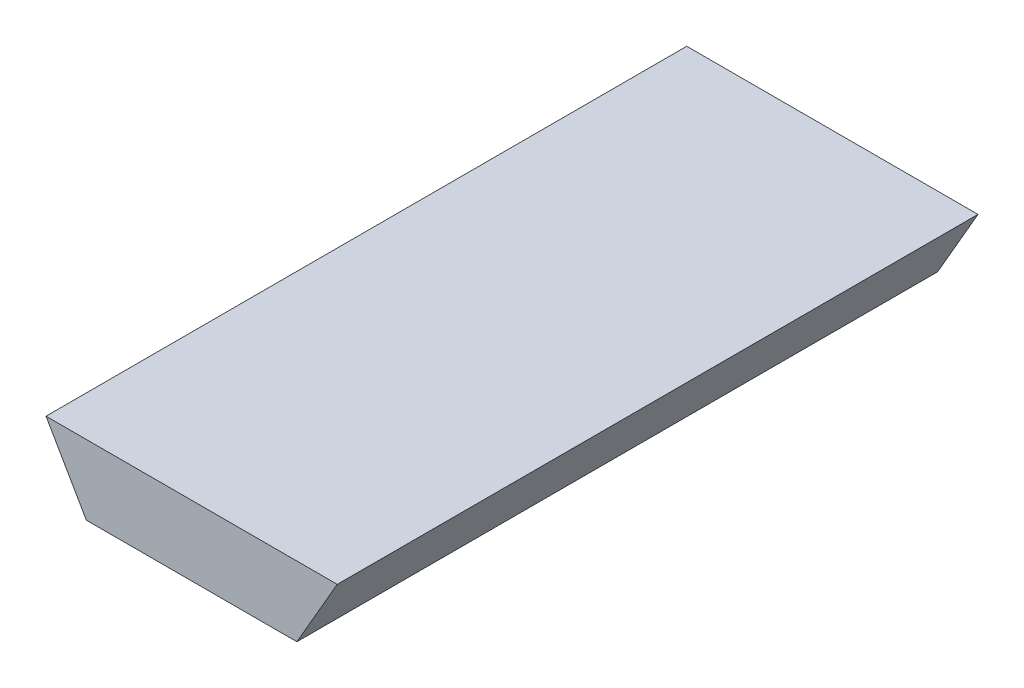
ISO-10303-21;
HEADER;
FILE_DESCRIPTION(('STEP AP214'),'2;1');
FILE_NAME('part.step','',(''),(''),'','','');
FILE_SCHEMA(('AUTOMOTIVE_DESIGN { 1 0 10303 214 1 1 1 1 }'));
ENDSEC;
DATA;
#1=APPLICATION_CONTEXT('core data for automotive mechanical design processes');
#2=APPLICATION_PROTOCOL_DEFINITION('international standard','automotive_design',2000,#1);
#3=PRODUCT_CONTEXT('',#1,'mechanical');
#4=PRODUCT('Part','Part','',(#3));
#5=PRODUCT_RELATED_PRODUCT_CATEGORY('part','',(#4));
#6=PRODUCT_DEFINITION_FORMATION('','',#4);
#7=PRODUCT_DEFINITION_CONTEXT('part definition',#1,'design');
#8=PRODUCT_DEFINITION('design','',#6,#7);
#9=PRODUCT_DEFINITION_SHAPE('','',#8);
#10=(LENGTH_UNIT() NAMED_UNIT(*) SI_UNIT(.MILLI.,.METRE.));
#11=(NAMED_UNIT(*) PLANE_ANGLE_UNIT() SI_UNIT($,.RADIAN.));
#12=(NAMED_UNIT(*) SI_UNIT($,.STERADIAN.) SOLID_ANGLE_UNIT());
#13=UNCERTAINTY_MEASURE_WITH_UNIT(LENGTH_MEASURE(1.E-05),#10,'distance_accuracy_value','');
#14=(GEOMETRIC_REPRESENTATION_CONTEXT(3) GLOBAL_UNCERTAINTY_ASSIGNED_CONTEXT((#13)) GLOBAL_UNIT_ASSIGNED_CONTEXT((#10,
#11,#12)) REPRESENTATION_CONTEXT('',''));
#15=CARTESIAN_POINT('',(0.,0.,0.));
#16=DIRECTION('',(0.,0.,1.));
#17=DIRECTION('',(1.,0.,0.));
#18=AXIS2_PLACEMENT_3D('',#15,#16,#17);
#19=CARTESIAN_POINT('',(-0.72099364905389,-0.416265877365273,-2.75));
#20=DIRECTION('',(-0.866025403784439,-0.5,0.));
#21=DIRECTION('',(0.5,-0.866025403784439,0.));
#22=AXIS2_PLACEMENT_3D('',#19,#20,#21);
#23=PLANE('',#22);
#24=DIRECTION('',(0.,0.,1.));
#25=VECTOR('',#24,1.);
#26=CARTESIAN_POINT('',(-0.903589838486224,-0.0999999999999992,-2.75));
#27=LINE('',#26,#25);
#28=CARTESIAN_POINT('',(-0.903589838486224,-0.0999999999999992,-2.75));
#29=VERTEX_POINT('',#28);
#30=CARTESIAN_POINT('',(-0.903589838486224,-0.0999999999999992,2.75));
#31=VERTEX_POINT('',#30);
#32=EDGE_CURVE('E40',#29,#31,#27,.T.);
#33=ORIENTED_EDGE('',*,*,#32,.T.);
#34=DIRECTION('',(0.5,-0.866025403784439,0.));
#35=VECTOR('',#34,1.);
#36=CARTESIAN_POINT('',(-0.72099364905389,-0.416265877365273,2.75));
#37=LINE('',#36,#35);
#38=CARTESIAN_POINT('',(-1.25,0.500000000000001,2.75));
#39=VERTEX_POINT('',#38);
#40=EDGE_CURVE('E78',#39,#31,#37,.T.);
#41=ORIENTED_EDGE('',*,*,#40,.F.);
#42=DIRECTION('',(0.,0.,1.));
#43=VECTOR('',#42,1.);
#44=CARTESIAN_POINT('',(-1.25,0.500000000000001,-2.75));
#45=LINE('',#44,#43);
#46=CARTESIAN_POINT('',(-1.25,0.500000000000001,-2.75));
#47=VERTEX_POINT('',#46);
#48=EDGE_CURVE('E11',#47,#39,#45,.T.);
#49=ORIENTED_EDGE('',*,*,#48,.F.);
#50=DIRECTION('',(0.5,-0.866025403784439,0.));
#51=VECTOR('',#50,1.);
#52=CARTESIAN_POINT('',(-0.72099364905389,-0.416265877365273,-2.75));
#53=LINE('',#52,#51);
#54=EDGE_CURVE('E80',#47,#29,#53,.T.);
#55=ORIENTED_EDGE('',*,*,#54,.T.);
#56=EDGE_LOOP('',(#33,#41,#49,#55));
#57=FACE_BOUND('',#56,.T.);
#58=ADVANCED_FACE('F37',(#57),#23,.T.);
#59=CARTESIAN_POINT('',(0.,0.500000000000001,-2.75));
#60=DIRECTION('',(0.,-1.,0.));
#61=DIRECTION('',(1.,0.,0.));
#62=AXIS2_PLACEMENT_3D('',#59,#60,#61);
#63=PLANE('',#62);
#64=ORIENTED_EDGE('',*,*,#48,.T.);
#65=DIRECTION('',(1.,0.,0.));
#66=VECTOR('',#65,1.);
#67=CARTESIAN_POINT('',(0.,0.500000000000001,2.75));
#68=LINE('',#67,#66);
#69=CARTESIAN_POINT('',(1.25,0.5,2.75));
#70=VERTEX_POINT('',#69);
#71=EDGE_CURVE('E95',#39,#70,#68,.T.);
#72=ORIENTED_EDGE('',*,*,#71,.T.);
#73=DIRECTION('',(0.,0.,1.));
#74=VECTOR('',#73,1.);
#75=CARTESIAN_POINT('',(1.25,0.5,-2.75));
#76=LINE('',#75,#74);
#77=CARTESIAN_POINT('',(1.25,0.5,-2.75));
#78=VERTEX_POINT('',#77);
#79=EDGE_CURVE('E45',#78,#70,#76,.T.);
#80=ORIENTED_EDGE('',*,*,#79,.F.);
#81=DIRECTION('',(1.,0.,0.));
#82=VECTOR('',#81,1.);
#83=CARTESIAN_POINT('',(0.,0.500000000000001,-2.75));
#84=LINE('',#83,#82);
#85=EDGE_CURVE('E58',#47,#78,#84,.T.);
#86=ORIENTED_EDGE('',*,*,#85,.F.);
#87=EDGE_LOOP('',(#64,#72,#80,#86));
#88=FACE_BOUND('',#87,.T.);
#89=ADVANCED_FACE('F110',(#88),#63,.F.);
#90=CARTESIAN_POINT('',(0.72099364905389,-0.416265877365274,-2.75));
#91=DIRECTION('',(0.866025403784439,-0.5,0.));
#92=DIRECTION('',(0.5,0.866025403784439,0.));
#93=AXIS2_PLACEMENT_3D('',#90,#91,#92);
#94=PLANE('',#93);
#95=ORIENTED_EDGE('',*,*,#79,.T.);
#96=DIRECTION('',(0.5,0.866025403784439,0.));
#97=VECTOR('',#96,1.);
#98=CARTESIAN_POINT('',(0.72099364905389,-0.416265877365274,2.75));
#99=LINE('',#98,#97);
#100=CARTESIAN_POINT('',(0.903589838486225,-0.0999999999999991,2.75));
#101=VERTEX_POINT('',#100);
#102=EDGE_CURVE('E91',#101,#70,#99,.T.);
#103=ORIENTED_EDGE('',*,*,#102,.F.);
#104=DIRECTION('',(0.,0.,1.));
#105=VECTOR('',#104,1.);
#106=CARTESIAN_POINT('',(0.903589838486225,-0.0999999999999991,-2.75));
#107=LINE('',#106,#105);
#108=CARTESIAN_POINT('',(0.903589838486225,-0.0999999999999991,-2.75));
#109=VERTEX_POINT('',#108);
#110=EDGE_CURVE('E84',#109,#101,#107,.T.);
#111=ORIENTED_EDGE('',*,*,#110,.F.);
#112=DIRECTION('',(0.5,0.866025403784439,0.));
#113=VECTOR('',#112,1.);
#114=CARTESIAN_POINT('',(0.72099364905389,-0.416265877365274,-2.75));
#115=LINE('',#114,#113);
#116=EDGE_CURVE('E103',#109,#78,#115,.T.);
#117=ORIENTED_EDGE('',*,*,#116,.T.);
#118=EDGE_LOOP('',(#95,#103,#111,#117));
#119=FACE_BOUND('',#118,.T.);
#120=ADVANCED_FACE('F108',(#119),#94,.T.);
#121=CARTESIAN_POINT('',(0.,-0.0999999999999992,-2.75));
#122=DIRECTION('',(0.,-1.,0.));
#123=DIRECTION('',(1.,0.,0.));
#124=AXIS2_PLACEMENT_3D('',#121,#122,#123);
#125=PLANE('',#124);
#126=ORIENTED_EDGE('',*,*,#110,.T.);
#127=DIRECTION('',(1.,0.,0.));
#128=VECTOR('',#127,1.);
#129=CARTESIAN_POINT('',(0.,-0.0999999999999992,2.75));
#130=LINE('',#129,#128);
#131=EDGE_CURVE('E86',#31,#101,#130,.T.);
#132=ORIENTED_EDGE('',*,*,#131,.F.);
#133=ORIENTED_EDGE('',*,*,#32,.F.);
#134=DIRECTION('',(1.,0.,0.));
#135=VECTOR('',#134,1.);
#136=CARTESIAN_POINT('',(0.,-0.0999999999999992,-2.75));
#137=LINE('',#136,#135);
#138=EDGE_CURVE('E101',#29,#109,#137,.T.);
#139=ORIENTED_EDGE('',*,*,#138,.T.);
#140=EDGE_LOOP('',(#126,#132,#133,#139));
#141=FACE_BOUND('',#140,.T.);
#142=ADVANCED_FACE('F87',(#141),#125,.T.);
#143=CARTESIAN_POINT('',(0.,0.,-2.75));
#144=DIRECTION('',(0.,0.,1.));
#145=DIRECTION('',(1.,0.,0.));
#146=AXIS2_PLACEMENT_3D('',#143,#144,#145);
#147=PLANE('',#146);
#148=ORIENTED_EDGE('',*,*,#54,.F.);
#149=ORIENTED_EDGE('',*,*,#85,.T.);
#150=ORIENTED_EDGE('',*,*,#116,.F.);
#151=ORIENTED_EDGE('',*,*,#138,.F.);
#152=EDGE_LOOP('',(#148,#149,#150,#151));
#153=FACE_BOUND('',#152,.T.);
#154=ADVANCED_FACE('F111',(#153),#147,.F.);
#155=CARTESIAN_POINT('',(0.,0.,2.75));
#156=DIRECTION('',(0.,0.,1.));
#157=DIRECTION('',(1.,0.,0.));
#158=AXIS2_PLACEMENT_3D('',#155,#156,#157);
#159=PLANE('',#158);
#160=ORIENTED_EDGE('',*,*,#40,.T.);
#161=ORIENTED_EDGE('',*,*,#131,.T.);
#162=ORIENTED_EDGE('',*,*,#102,.T.);
#163=ORIENTED_EDGE('',*,*,#71,.F.);
#164=EDGE_LOOP('',(#160,#161,#162,#163));
#165=FACE_BOUND('',#164,.T.);
#166=ADVANCED_FACE('F93',(#165),#159,.T.);
#167=CLOSED_SHELL('',(#58,#89,#120,#142,#154,#166));
#168=MANIFOLD_SOLID_BREP('B2',#167);
#169=ADVANCED_BREP_SHAPE_REPRESENTATION('',(#18,#168),#14);
#170=SHAPE_DEFINITION_REPRESENTATION(#9,#169);
ENDSEC;
END-ISO-10303-21;
